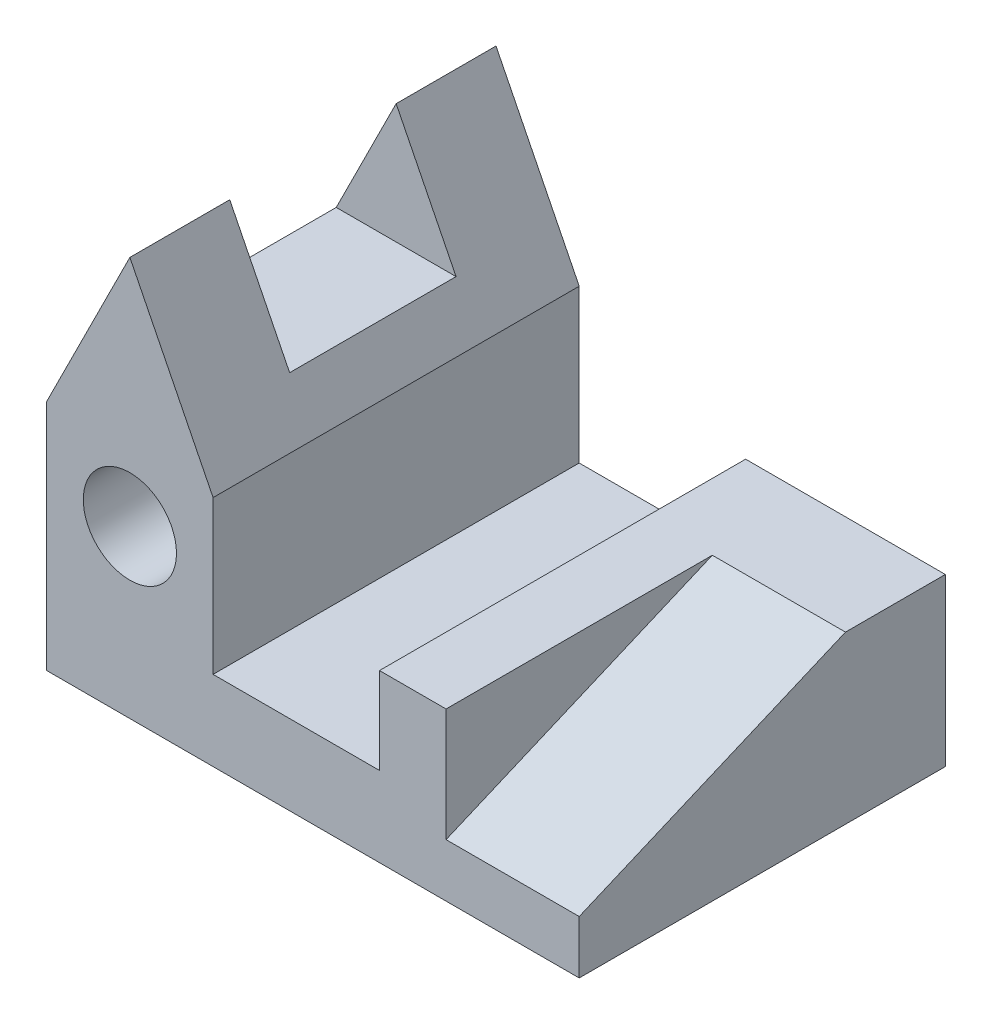
ISO-10303-21;
HEADER;
FILE_DESCRIPTION(('STEP AP214'),'2;1');
FILE_NAME('part.step','',(''),(''),'','','');
FILE_SCHEMA(('AUTOMOTIVE_DESIGN { 1 0 10303 214 1 1 1 1 }'));
ENDSEC;
DATA;
#1=APPLICATION_CONTEXT('core data for automotive mechanical design processes');
#2=APPLICATION_PROTOCOL_DEFINITION('international standard','automotive_design',2000,#1);
#3=PRODUCT_CONTEXT('',#1,'mechanical');
#4=PRODUCT('Part','Part','',(#3));
#5=PRODUCT_RELATED_PRODUCT_CATEGORY('part','',(#4));
#6=PRODUCT_DEFINITION_FORMATION('','',#4);
#7=PRODUCT_DEFINITION_CONTEXT('part definition',#1,'design');
#8=PRODUCT_DEFINITION('design','',#6,#7);
#9=PRODUCT_DEFINITION_SHAPE('','',#8);
#10=(LENGTH_UNIT() NAMED_UNIT(*) SI_UNIT(.MILLI.,.METRE.));
#11=(NAMED_UNIT(*) PLANE_ANGLE_UNIT() SI_UNIT($,.RADIAN.));
#12=(NAMED_UNIT(*) SI_UNIT($,.STERADIAN.) SOLID_ANGLE_UNIT());
#13=UNCERTAINTY_MEASURE_WITH_UNIT(LENGTH_MEASURE(1.E-05),#10,'distance_accuracy_value','');
#14=(GEOMETRIC_REPRESENTATION_CONTEXT(3) GLOBAL_UNCERTAINTY_ASSIGNED_CONTEXT((#13)) GLOBAL_UNIT_ASSIGNED_CONTEXT((#10,
#11,#12)) REPRESENTATION_CONTEXT('',''));
#15=CARTESIAN_POINT('',(0.,0.,0.));
#16=DIRECTION('',(0.,0.,1.));
#17=DIRECTION('',(1.,0.,0.));
#18=AXIS2_PLACEMENT_3D('',#15,#16,#17);
#19=CARTESIAN_POINT('',(80.,0.,55.));
#20=DIRECTION('',(-1.,0.,0.));
#21=DIRECTION('',(0.,0.,1.));
#22=AXIS2_PLACEMENT_3D('',#19,#20,#21);
#23=PLANE('',#22);
#24=DIRECTION('',(0.,-0.391140640344852,0.920330918458475));
#25=VECTOR('',#24,1.);
#26=CARTESIAN_POINT('',(80.,26.5749073583907,11.294335627316));
#27=LINE('',#26,#25);
#28=CARTESIAN_POINT('',(80.,25.,15.));
#29=VERTEX_POINT('',#28);
#30=CARTESIAN_POINT('',(80.,8.,55.));
#31=VERTEX_POINT('',#30);
#32=EDGE_CURVE('E146',#29,#31,#27,.T.);
#33=ORIENTED_EDGE('',*,*,#32,.T.);
#34=DIRECTION('',(0.,1.,0.));
#35=VECTOR('',#34,1.);
#36=CARTESIAN_POINT('',(80.,0.,55.));
#37=LINE('',#36,#35);
#38=CARTESIAN_POINT('',(80.,0.,55.));
#39=VERTEX_POINT('',#38);
#40=EDGE_CURVE('E215',#39,#31,#37,.T.);
#41=ORIENTED_EDGE('',*,*,#40,.F.);
#42=DIRECTION('',(0.,0.,-1.));
#43=VECTOR('',#42,1.);
#44=CARTESIAN_POINT('',(80.,0.,55.));
#45=LINE('',#44,#43);
#46=CARTESIAN_POINT('',(80.,0.,0.));
#47=VERTEX_POINT('',#46);
#48=EDGE_CURVE('E48',#39,#47,#45,.T.);
#49=ORIENTED_EDGE('',*,*,#48,.T.);
#50=DIRECTION('',(0.,1.,0.));
#51=VECTOR('',#50,1.);
#52=CARTESIAN_POINT('',(80.,0.,0.));
#53=LINE('',#52,#51);
#54=CARTESIAN_POINT('',(80.,25.,0.));
#55=VERTEX_POINT('',#54);
#56=EDGE_CURVE('E243',#47,#55,#53,.T.);
#57=ORIENTED_EDGE('',*,*,#56,.T.);
#58=DIRECTION('',(0.,0.,-1.));
#59=VECTOR('',#58,1.);
#60=CARTESIAN_POINT('',(80.,25.,55.));
#61=LINE('',#60,#59);
#62=EDGE_CURVE('E289',#29,#55,#61,.T.);
#63=ORIENTED_EDGE('',*,*,#62,.F.);
#64=EDGE_LOOP('',(#33,#41,#49,#57,#63));
#65=FACE_BOUND('',#64,.T.);
#66=ADVANCED_FACE('F39',(#65),#23,.F.);
#67=CARTESIAN_POINT('',(80.,25.,55.));
#68=DIRECTION('',(0.,-1.,0.));
#69=DIRECTION('',(1.,0.,0.));
#70=AXIS2_PLACEMENT_3D('',#67,#68,#69);
#71=PLANE('',#70);
#72=DIRECTION('',(1.,0.,0.));
#73=VECTOR('',#72,1.);
#74=CARTESIAN_POINT('',(60.,25.,15.));
#75=LINE('',#74,#73);
#76=CARTESIAN_POINT('',(60.,25.,15.));
#77=VERTEX_POINT('',#76);
#78=EDGE_CURVE('E142',#77,#29,#75,.T.);
#79=ORIENTED_EDGE('',*,*,#78,.T.);
#80=ORIENTED_EDGE('',*,*,#62,.T.);
#81=DIRECTION('',(-1.,0.,0.));
#82=VECTOR('',#81,1.);
#83=CARTESIAN_POINT('',(80.,25.,0.));
#84=LINE('',#83,#82);
#85=CARTESIAN_POINT('',(50.,25.,0.));
#86=VERTEX_POINT('',#85);
#87=EDGE_CURVE('E247',#55,#86,#84,.T.);
#88=ORIENTED_EDGE('',*,*,#87,.T.);
#89=DIRECTION('',(0.,0.,-1.));
#90=VECTOR('',#89,1.);
#91=CARTESIAN_POINT('',(50.,25.,55.));
#92=LINE('',#91,#90);
#93=CARTESIAN_POINT('',(50.,25.,55.));
#94=VERTEX_POINT('',#93);
#95=EDGE_CURVE('E285',#94,#86,#92,.T.);
#96=ORIENTED_EDGE('',*,*,#95,.F.);
#97=DIRECTION('',(-1.,0.,0.));
#98=VECTOR('',#97,1.);
#99=CARTESIAN_POINT('',(80.,25.,55.));
#100=LINE('',#99,#98);
#101=CARTESIAN_POINT('',(60.,25.,55.));
#102=VERTEX_POINT('',#101);
#103=EDGE_CURVE('E160',#102,#94,#100,.T.);
#104=ORIENTED_EDGE('',*,*,#103,.F.);
#105=DIRECTION('',(0.,0.,1.));
#106=VECTOR('',#105,1.);
#107=CARTESIAN_POINT('',(60.,25.,0.));
#108=LINE('',#107,#106);
#109=EDGE_CURVE('E55',#77,#102,#108,.T.);
#110=ORIENTED_EDGE('',*,*,#109,.F.);
#111=EDGE_LOOP('',(#79,#80,#88,#96,#104,#110));
#112=FACE_BOUND('',#111,.T.);
#113=ADVANCED_FACE('F158',(#112),#71,.F.);
#114=CARTESIAN_POINT('',(0.,0.,55.));
#115=DIRECTION('',(0.,0.,-1.));
#116=DIRECTION('',(-1.,0.,0.));
#117=AXIS2_PLACEMENT_3D('',#114,#115,#116);
#118=PLANE('',#117);
#119=CARTESIAN_POINT('',(12.5,25.,55.));
#120=DIRECTION('',(0.,0.,1.));
#121=DIRECTION('',(1.,0.,0.));
#122=AXIS2_PLACEMENT_3D('',#119,#120,#121);
#123=CIRCLE('',#122,7.);
#124=CARTESIAN_POINT('',(19.5,25.,55.));
#125=VERTEX_POINT('',#124);
#126=EDGE_CURVE('E196',#125,#125,#123,.T.);
#127=ORIENTED_EDGE('',*,*,#126,.F.);
#128=EDGE_LOOP('',(#127));
#129=FACE_BOUND('',#128,.T.);
#130=DIRECTION('',(1.,0.,0.));
#131=VECTOR('',#130,1.);
#132=CARTESIAN_POINT('',(60.,8.,55.));
#133=LINE('',#132,#131);
#134=CARTESIAN_POINT('',(60.,8.,55.));
#135=VERTEX_POINT('',#134);
#136=EDGE_CURVE('E150',#135,#31,#133,.T.);
#137=ORIENTED_EDGE('',*,*,#136,.F.);
#138=DIRECTION('',(0.,-1.,0.));
#139=VECTOR('',#138,1.);
#140=CARTESIAN_POINT('',(60.,0.,55.));
#141=LINE('',#140,#139);
#142=EDGE_CURVE('E151',#102,#135,#141,.T.);
#143=ORIENTED_EDGE('',*,*,#142,.F.);
#144=ORIENTED_EDGE('',*,*,#103,.T.);
#145=DIRECTION('',(0.,-1.,0.));
#146=VECTOR('',#145,1.);
#147=CARTESIAN_POINT('',(50.,12.,55.));
#148=LINE('',#147,#146);
#149=CARTESIAN_POINT('',(50.,12.,55.));
#150=VERTEX_POINT('',#149);
#151=EDGE_CURVE('E221',#94,#150,#148,.T.);
#152=ORIENTED_EDGE('',*,*,#151,.T.);
#153=DIRECTION('',(-1.,0.,0.));
#154=VECTOR('',#153,1.);
#155=CARTESIAN_POINT('',(25.,12.,55.));
#156=LINE('',#155,#154);
#157=CARTESIAN_POINT('',(25.,12.,55.));
#158=VERTEX_POINT('',#157);
#159=EDGE_CURVE('E224',#150,#158,#156,.T.);
#160=ORIENTED_EDGE('',*,*,#159,.T.);
#161=DIRECTION('',(0.,1.,0.));
#162=VECTOR('',#161,1.);
#163=CARTESIAN_POINT('',(25.,12.,55.));
#164=LINE('',#163,#162);
#165=CARTESIAN_POINT('',(25.,35.,55.));
#166=VERTEX_POINT('',#165);
#167=EDGE_CURVE('E227',#158,#166,#164,.T.);
#168=ORIENTED_EDGE('',*,*,#167,.T.);
#169=DIRECTION('',(-0.447213595499958,0.894427190999916,0.));
#170=VECTOR('',#169,1.);
#171=CARTESIAN_POINT('',(12.5,60.,55.));
#172=LINE('',#171,#170);
#173=CARTESIAN_POINT('',(12.5,60.,55.));
#174=VERTEX_POINT('',#173);
#175=EDGE_CURVE('E230',#166,#174,#172,.T.);
#176=ORIENTED_EDGE('',*,*,#175,.T.);
#177=DIRECTION('',(-0.447213595499958,-0.894427190999916,0.));
#178=VECTOR('',#177,1.);
#179=CARTESIAN_POINT('',(0.,35.,55.));
#180=LINE('',#179,#178);
#181=CARTESIAN_POINT('',(0.,35.,55.));
#182=VERTEX_POINT('',#181);
#183=EDGE_CURVE('E233',#174,#182,#180,.T.);
#184=ORIENTED_EDGE('',*,*,#183,.T.);
#185=DIRECTION('',(0.,-1.,0.));
#186=VECTOR('',#185,1.);
#187=CARTESIAN_POINT('',(0.,0.,55.));
#188=LINE('',#187,#186);
#189=CARTESIAN_POINT('',(0.,0.,55.));
#190=VERTEX_POINT('',#189);
#191=EDGE_CURVE('E207',#182,#190,#188,.T.);
#192=ORIENTED_EDGE('',*,*,#191,.T.);
#193=DIRECTION('',(1.,0.,0.));
#194=VECTOR('',#193,1.);
#195=CARTESIAN_POINT('',(0.,0.,55.));
#196=LINE('',#195,#194);
#197=EDGE_CURVE('E211',#190,#39,#196,.T.);
#198=ORIENTED_EDGE('',*,*,#197,.T.);
#199=ORIENTED_EDGE('',*,*,#40,.T.);
#200=EDGE_LOOP('',(#137,#143,#144,#152,#160,#168,#176,#184,#192,#198,#199));
#201=FACE_BOUND('',#200,.T.);
#202=ADVANCED_FACE('F310',(#129,#201),#118,.F.);
#203=CARTESIAN_POINT('',(12.5,60.,55.));
#204=DIRECTION('',(-0.894427190999916,-0.447213595499958,0.));
#205=DIRECTION('',(0.447213595499958,-0.894427190999916,0.));
#206=AXIS2_PLACEMENT_3D('',#203,#204,#205);
#207=PLANE('',#206);
#208=DIRECTION('',(-0.447213595499958,0.894427190999916,0.));
#209=VECTOR('',#208,1.);
#210=CARTESIAN_POINT('',(21.5,42.,15.));
#211=LINE('',#210,#209);
#212=CARTESIAN_POINT('',(21.5,42.,15.));
#213=VERTEX_POINT('',#212);
#214=CARTESIAN_POINT('',(12.5,60.,15.));
#215=VERTEX_POINT('',#214);
#216=EDGE_CURVE('E180',#213,#215,#211,.T.);
#217=ORIENTED_EDGE('',*,*,#216,.F.);
#218=DIRECTION('',(0.,0.,1.));
#219=VECTOR('',#218,1.);
#220=CARTESIAN_POINT('',(21.5,42.,15.));
#221=LINE('',#220,#219);
#222=CARTESIAN_POINT('',(21.5,42.,40.));
#223=VERTEX_POINT('',#222);
#224=EDGE_CURVE('E192',#213,#223,#221,.T.);
#225=ORIENTED_EDGE('',*,*,#224,.T.);
#226=DIRECTION('',(-0.447213595499958,0.894427190999916,0.));
#227=VECTOR('',#226,1.);
#228=CARTESIAN_POINT('',(21.5,42.,40.));
#229=LINE('',#228,#227);
#230=CARTESIAN_POINT('',(12.5,60.,40.));
#231=VERTEX_POINT('',#230);
#232=EDGE_CURVE('E176',#223,#231,#229,.T.);
#233=ORIENTED_EDGE('',*,*,#232,.T.);
#234=DIRECTION('',(0.,0.,-1.));
#235=VECTOR('',#234,1.);
#236=CARTESIAN_POINT('',(12.5,60.,55.));
#237=LINE('',#236,#235);
#238=EDGE_CURVE('E269',#174,#231,#237,.T.);
#239=ORIENTED_EDGE('',*,*,#238,.F.);
#240=ORIENTED_EDGE('',*,*,#175,.F.);
#241=DIRECTION('',(0.,0.,-1.));
#242=VECTOR('',#241,1.);
#243=CARTESIAN_POINT('',(25.,35.,55.));
#244=LINE('',#243,#242);
#245=CARTESIAN_POINT('',(25.,35.,0.));
#246=VERTEX_POINT('',#245);
#247=EDGE_CURVE('E273',#166,#246,#244,.T.);
#248=ORIENTED_EDGE('',*,*,#247,.T.);
#249=DIRECTION('',(-0.447213595499958,0.894427190999916,0.));
#250=VECTOR('',#249,1.);
#251=CARTESIAN_POINT('',(12.5,60.,0.));
#252=LINE('',#251,#250);
#253=CARTESIAN_POINT('',(12.5,60.,0.));
#254=VERTEX_POINT('',#253);
#255=EDGE_CURVE('E259',#246,#254,#252,.T.);
#256=ORIENTED_EDGE('',*,*,#255,.T.);
#257=EDGE_CURVE('E268',#215,#254,#237,.T.);
#258=ORIENTED_EDGE('',*,*,#257,.F.);
#259=EDGE_LOOP('',(#217,#225,#233,#239,#240,#248,#256,#258));
#260=FACE_BOUND('',#259,.T.);
#261=ADVANCED_FACE('F329',(#260),#207,.F.);
#262=CARTESIAN_POINT('',(0.,35.,55.));
#263=DIRECTION('',(0.894427190999916,-0.447213595499958,0.));
#264=DIRECTION('',(0.447213595499958,0.894427190999916,0.));
#265=AXIS2_PLACEMENT_3D('',#262,#263,#264);
#266=PLANE('',#265);
#267=DIRECTION('',(-0.447213595499958,-0.894427190999916,0.));
#268=VECTOR('',#267,1.);
#269=CARTESIAN_POINT('',(12.5,60.,15.));
#270=LINE('',#269,#268);
#271=CARTESIAN_POINT('',(3.5,42.,15.));
#272=VERTEX_POINT('',#271);
#273=EDGE_CURVE('E171',#215,#272,#270,.T.);
#274=ORIENTED_EDGE('',*,*,#273,.F.);
#275=ORIENTED_EDGE('',*,*,#257,.T.);
#276=DIRECTION('',(-0.447213595499958,-0.894427190999916,0.));
#277=VECTOR('',#276,1.);
#278=CARTESIAN_POINT('',(0.,35.,0.));
#279=LINE('',#278,#277);
#280=CARTESIAN_POINT('',(0.,35.,0.));
#281=VERTEX_POINT('',#280);
#282=EDGE_CURVE('E212',#254,#281,#279,.T.);
#283=ORIENTED_EDGE('',*,*,#282,.T.);
#284=DIRECTION('',(0.,0.,-1.));
#285=VECTOR('',#284,1.);
#286=CARTESIAN_POINT('',(0.,35.,55.));
#287=LINE('',#286,#285);
#288=EDGE_CURVE('E236',#182,#281,#287,.T.);
#289=ORIENTED_EDGE('',*,*,#288,.F.);
#290=ORIENTED_EDGE('',*,*,#183,.F.);
#291=ORIENTED_EDGE('',*,*,#238,.T.);
#292=DIRECTION('',(-0.447213595499958,-0.894427190999916,0.));
#293=VECTOR('',#292,1.);
#294=CARTESIAN_POINT('',(12.5,60.,40.));
#295=LINE('',#294,#293);
#296=CARTESIAN_POINT('',(3.5,42.,40.));
#297=VERTEX_POINT('',#296);
#298=EDGE_CURVE('E169',#231,#297,#295,.T.);
#299=ORIENTED_EDGE('',*,*,#298,.T.);
#300=DIRECTION('',(0.,0.,1.));
#301=VECTOR('',#300,1.);
#302=CARTESIAN_POINT('',(3.5,42.,15.));
#303=LINE('',#302,#301);
#304=EDGE_CURVE('E183',#272,#297,#303,.T.);
#305=ORIENTED_EDGE('',*,*,#304,.F.);
#306=EDGE_LOOP('',(#274,#275,#283,#289,#290,#291,#299,#305));
#307=FACE_BOUND('',#306,.T.);
#308=ADVANCED_FACE('F322',(#307),#266,.F.);
#309=CARTESIAN_POINT('',(0.,0.,55.));
#310=DIRECTION('',(1.,0.,0.));
#311=DIRECTION('',(0.,0.,-1.));
#312=AXIS2_PLACEMENT_3D('',#309,#310,#311);
#313=PLANE('',#312);
#314=DIRECTION('',(0.,-1.,0.));
#315=VECTOR('',#314,1.);
#316=CARTESIAN_POINT('',(0.,0.,0.));
#317=LINE('',#316,#315);
#318=CARTESIAN_POINT('',(0.,0.,0.));
#319=VERTEX_POINT('',#318);
#320=EDGE_CURVE('E203',#281,#319,#317,.T.);
#321=ORIENTED_EDGE('',*,*,#320,.T.);
#322=DIRECTION('',(0.,0.,-1.));
#323=VECTOR('',#322,1.);
#324=CARTESIAN_POINT('',(0.,0.,55.));
#325=LINE('',#324,#323);
#326=EDGE_CURVE('E11',#190,#319,#325,.T.);
#327=ORIENTED_EDGE('',*,*,#326,.F.);
#328=ORIENTED_EDGE('',*,*,#191,.F.);
#329=ORIENTED_EDGE('',*,*,#288,.T.);
#330=EDGE_LOOP('',(#321,#327,#328,#329));
#331=FACE_BOUND('',#330,.T.);
#332=ADVANCED_FACE('F41',(#331),#313,.F.);
#333=CARTESIAN_POINT('',(0.,0.,55.));
#334=DIRECTION('',(0.,1.,0.));
#335=DIRECTION('',(0.,0.,1.));
#336=AXIS2_PLACEMENT_3D('',#333,#334,#335);
#337=PLANE('',#336);
#338=DIRECTION('',(1.,0.,0.));
#339=VECTOR('',#338,1.);
#340=CARTESIAN_POINT('',(0.,0.,0.));
#341=LINE('',#340,#339);
#342=EDGE_CURVE('E240',#319,#47,#341,.T.);
#343=ORIENTED_EDGE('',*,*,#342,.T.);
#344=ORIENTED_EDGE('',*,*,#48,.F.);
#345=ORIENTED_EDGE('',*,*,#197,.F.);
#346=ORIENTED_EDGE('',*,*,#326,.T.);
#347=EDGE_LOOP('',(#343,#344,#345,#346));
#348=FACE_BOUND('',#347,.T.);
#349=ADVANCED_FACE('F314',(#348),#337,.F.);
#350=CARTESIAN_POINT('',(50.,12.,55.));
#351=DIRECTION('',(1.,0.,0.));
#352=DIRECTION('',(0.,0.,-1.));
#353=AXIS2_PLACEMENT_3D('',#350,#351,#352);
#354=PLANE('',#353);
#355=DIRECTION('',(0.,-1.,0.));
#356=VECTOR('',#355,1.);
#357=CARTESIAN_POINT('',(50.,12.,0.));
#358=LINE('',#357,#356);
#359=CARTESIAN_POINT('',(50.,12.,0.));
#360=VERTEX_POINT('',#359);
#361=EDGE_CURVE('E250',#86,#360,#358,.T.);
#362=ORIENTED_EDGE('',*,*,#361,.T.);
#363=DIRECTION('',(0.,0.,-1.));
#364=VECTOR('',#363,1.);
#365=CARTESIAN_POINT('',(50.,12.,55.));
#366=LINE('',#365,#364);
#367=EDGE_CURVE('E281',#150,#360,#366,.T.);
#368=ORIENTED_EDGE('',*,*,#367,.F.);
#369=ORIENTED_EDGE('',*,*,#151,.F.);
#370=ORIENTED_EDGE('',*,*,#95,.T.);
#371=EDGE_LOOP('',(#362,#368,#369,#370));
#372=FACE_BOUND('',#371,.T.);
#373=ADVANCED_FACE('F306',(#372),#354,.F.);
#374=CARTESIAN_POINT('',(25.,12.,55.));
#375=DIRECTION('',(0.,-1.,0.));
#376=DIRECTION('',(0.,0.,-1.));
#377=AXIS2_PLACEMENT_3D('',#374,#375,#376);
#378=PLANE('',#377);
#379=DIRECTION('',(-1.,0.,0.));
#380=VECTOR('',#379,1.);
#381=CARTESIAN_POINT('',(25.,12.,0.));
#382=LINE('',#381,#380);
#383=CARTESIAN_POINT('',(25.,12.,0.));
#384=VERTEX_POINT('',#383);
#385=EDGE_CURVE('E253',#360,#384,#382,.T.);
#386=ORIENTED_EDGE('',*,*,#385,.T.);
#387=DIRECTION('',(0.,0.,-1.));
#388=VECTOR('',#387,1.);
#389=CARTESIAN_POINT('',(25.,12.,55.));
#390=LINE('',#389,#388);
#391=EDGE_CURVE('E277',#158,#384,#390,.T.);
#392=ORIENTED_EDGE('',*,*,#391,.F.);
#393=ORIENTED_EDGE('',*,*,#159,.F.);
#394=ORIENTED_EDGE('',*,*,#367,.T.);
#395=EDGE_LOOP('',(#386,#392,#393,#394));
#396=FACE_BOUND('',#395,.T.);
#397=ADVANCED_FACE('F337',(#396),#378,.F.);
#398=CARTESIAN_POINT('',(25.,12.,55.));
#399=DIRECTION('',(-1.,0.,0.));
#400=DIRECTION('',(0.,0.,1.));
#401=AXIS2_PLACEMENT_3D('',#398,#399,#400);
#402=PLANE('',#401);
#403=DIRECTION('',(0.,1.,0.));
#404=VECTOR('',#403,1.);
#405=CARTESIAN_POINT('',(25.,12.,0.));
#406=LINE('',#405,#404);
#407=EDGE_CURVE('E256',#384,#246,#406,.T.);
#408=ORIENTED_EDGE('',*,*,#407,.T.);
#409=ORIENTED_EDGE('',*,*,#247,.F.);
#410=ORIENTED_EDGE('',*,*,#167,.F.);
#411=ORIENTED_EDGE('',*,*,#391,.T.);
#412=EDGE_LOOP('',(#408,#409,#410,#411));
#413=FACE_BOUND('',#412,.T.);
#414=ADVANCED_FACE('F335',(#413),#402,.F.);
#415=CARTESIAN_POINT('',(0.,0.,0.));
#416=DIRECTION('',(0.,0.,-1.));
#417=DIRECTION('',(-1.,0.,0.));
#418=AXIS2_PLACEMENT_3D('',#415,#416,#417);
#419=PLANE('',#418);
#420=CARTESIAN_POINT('',(12.5,25.,0.));
#421=DIRECTION('',(0.,0.,1.));
#422=DIRECTION('',(1.,0.,0.));
#423=AXIS2_PLACEMENT_3D('',#420,#421,#422);
#424=CIRCLE('',#423,7.);
#425=CARTESIAN_POINT('',(19.5,25.,0.));
#426=VERTEX_POINT('',#425);
#427=EDGE_CURVE('E199',#426,#426,#424,.T.);
#428=ORIENTED_EDGE('',*,*,#427,.T.);
#429=EDGE_LOOP('',(#428));
#430=FACE_BOUND('',#429,.T.);
#431=ORIENTED_EDGE('',*,*,#320,.F.);
#432=ORIENTED_EDGE('',*,*,#282,.F.);
#433=ORIENTED_EDGE('',*,*,#255,.F.);
#434=ORIENTED_EDGE('',*,*,#407,.F.);
#435=ORIENTED_EDGE('',*,*,#385,.F.);
#436=ORIENTED_EDGE('',*,*,#361,.F.);
#437=ORIENTED_EDGE('',*,*,#87,.F.);
#438=ORIENTED_EDGE('',*,*,#56,.F.);
#439=ORIENTED_EDGE('',*,*,#342,.F.);
#440=EDGE_LOOP('',(#431,#432,#433,#434,#435,#436,#437,#438,#439));
#441=FACE_BOUND('',#440,.T.);
#442=ADVANCED_FACE('F301',(#430,#441),#419,.T.);
#443=CARTESIAN_POINT('',(12.5,25.,0.));
#444=DIRECTION('',(0.,0.,1.));
#445=DIRECTION('',(1.,0.,0.));
#446=AXIS2_PLACEMENT_3D('',#443,#444,#445);
#447=CYLINDRICAL_SURFACE('',#446,7.);
#448=ORIENTED_EDGE('',*,*,#427,.F.);
#449=EDGE_LOOP('',(#448));
#450=FACE_BOUND('',#449,.T.);
#451=ORIENTED_EDGE('',*,*,#126,.T.);
#452=EDGE_LOOP('',(#451));
#453=FACE_BOUND('',#452,.T.);
#454=ADVANCED_FACE('F367',(#450,#453),#447,.F.);
#455=CARTESIAN_POINT('',(3.5,42.,15.));
#456=DIRECTION('',(0.,-1.,0.));
#457=DIRECTION('',(0.,0.,-1.));
#458=AXIS2_PLACEMENT_3D('',#455,#456,#457);
#459=PLANE('',#458);
#460=DIRECTION('',(1.,0.,0.));
#461=VECTOR('',#460,1.);
#462=CARTESIAN_POINT('',(3.5,42.,40.));
#463=LINE('',#462,#461);
#464=EDGE_CURVE('E63',#297,#223,#463,.T.);
#465=ORIENTED_EDGE('',*,*,#464,.T.);
#466=ORIENTED_EDGE('',*,*,#224,.F.);
#467=DIRECTION('',(1.,0.,0.));
#468=VECTOR('',#467,1.);
#469=CARTESIAN_POINT('',(3.5,42.,15.));
#470=LINE('',#469,#468);
#471=EDGE_CURVE('E175',#272,#213,#470,.T.);
#472=ORIENTED_EDGE('',*,*,#471,.F.);
#473=ORIENTED_EDGE('',*,*,#304,.T.);
#474=EDGE_LOOP('',(#465,#466,#472,#473));
#475=FACE_BOUND('',#474,.T.);
#476=ADVANCED_FACE('F374',(#475),#459,.F.);
#477=CARTESIAN_POINT('',(0.,0.,15.));
#478=DIRECTION('',(0.,0.,1.));
#479=DIRECTION('',(1.,0.,0.));
#480=AXIS2_PLACEMENT_3D('',#477,#478,#479);
#481=PLANE('',#480);
#482=ORIENTED_EDGE('',*,*,#273,.T.);
#483=ORIENTED_EDGE('',*,*,#471,.T.);
#484=ORIENTED_EDGE('',*,*,#216,.T.);
#485=EDGE_LOOP('',(#482,#483,#484));
#486=FACE_BOUND('',#485,.T.);
#487=ADVANCED_FACE('F378',(#486),#481,.T.);
#488=CARTESIAN_POINT('',(0.,0.,40.));
#489=DIRECTION('',(0.,0.,1.));
#490=DIRECTION('',(1.,0.,0.));
#491=AXIS2_PLACEMENT_3D('',#488,#489,#490);
#492=PLANE('',#491);
#493=ORIENTED_EDGE('',*,*,#298,.F.);
#494=ORIENTED_EDGE('',*,*,#232,.F.);
#495=ORIENTED_EDGE('',*,*,#464,.F.);
#496=EDGE_LOOP('',(#493,#494,#495));
#497=FACE_BOUND('',#496,.T.);
#498=ADVANCED_FACE('F380',(#497),#492,.F.);
#499=CARTESIAN_POINT('',(60.,26.5749073583907,11.294335627316));
#500=DIRECTION('',(0.,0.920330918458475,0.391140640344852));
#501=DIRECTION('',(0.,-0.391140640344852,0.920330918458475));
#502=AXIS2_PLACEMENT_3D('',#499,#500,#501);
#503=PLANE('',#502);
#504=ORIENTED_EDGE('',*,*,#32,.F.);
#505=ORIENTED_EDGE('',*,*,#78,.F.);
#506=DIRECTION('',(0.,-0.391140640344852,0.920330918458475));
#507=VECTOR('',#506,1.);
#508=CARTESIAN_POINT('',(60.,26.5749073583907,11.294335627316));
#509=LINE('',#508,#507);
#510=EDGE_CURVE('E144',#77,#135,#509,.T.);
#511=ORIENTED_EDGE('',*,*,#510,.T.);
#512=ORIENTED_EDGE('',*,*,#136,.T.);
#513=EDGE_LOOP('',(#504,#505,#511,#512));
#514=FACE_BOUND('',#513,.T.);
#515=ADVANCED_FACE('F143',(#514),#503,.T.);
#516=CARTESIAN_POINT('',(60.,0.,0.));
#517=DIRECTION('',(1.,0.,0.));
#518=DIRECTION('',(0.,0.,-1.));
#519=AXIS2_PLACEMENT_3D('',#516,#517,#518);
#520=PLANE('',#519);
#521=ORIENTED_EDGE('',*,*,#510,.F.);
#522=ORIENTED_EDGE('',*,*,#109,.T.);
#523=ORIENTED_EDGE('',*,*,#142,.T.);
#524=EDGE_LOOP('',(#521,#522,#523));
#525=FACE_BOUND('',#524,.T.);
#526=ADVANCED_FACE('F153',(#525),#520,.T.);
#527=CLOSED_SHELL('',(#66,#113,#202,#261,#308,#332,#349,#373,#397,#414,#442,#454,#476,#487,#498,
#515,#526));
#528=MANIFOLD_SOLID_BREP('B2',#527);
#529=ADVANCED_BREP_SHAPE_REPRESENTATION('',(#18,#528),#14);
#530=SHAPE_DEFINITION_REPRESENTATION(#9,#529);
ENDSEC;
END-ISO-10303-21;
